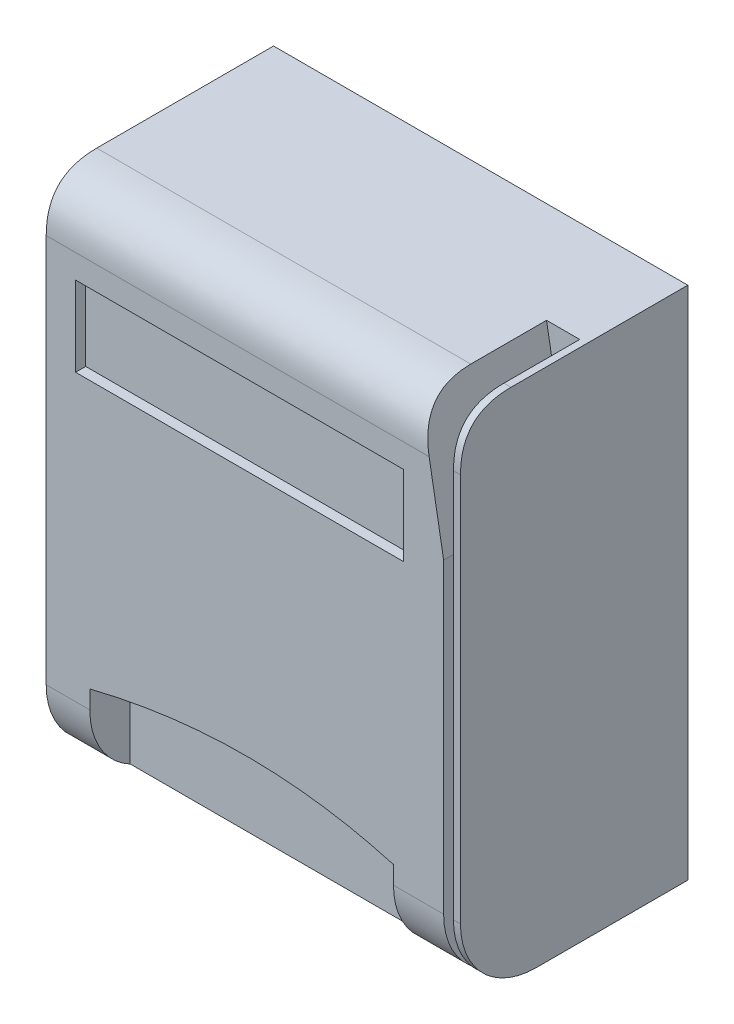
ISO-10303-21;
HEADER;
FILE_DESCRIPTION(('STEP AP214'),'2;1');
FILE_NAME('part.step','',(''),(''),'','','');
FILE_SCHEMA(('AUTOMOTIVE_DESIGN { 1 0 10303 214 1 1 1 1 }'));
ENDSEC;
DATA;
#1=APPLICATION_CONTEXT('core data for automotive mechanical design processes');
#2=APPLICATION_PROTOCOL_DEFINITION('international standard','automotive_design',2000,#1);
#3=PRODUCT_CONTEXT('',#1,'mechanical');
#4=PRODUCT('Part','Part','',(#3));
#5=PRODUCT_RELATED_PRODUCT_CATEGORY('part','',(#4));
#6=PRODUCT_DEFINITION_FORMATION('','',#4);
#7=PRODUCT_DEFINITION_CONTEXT('part definition',#1,'design');
#8=PRODUCT_DEFINITION('design','',#6,#7);
#9=PRODUCT_DEFINITION_SHAPE('','',#8);
#10=(LENGTH_UNIT() NAMED_UNIT(*) SI_UNIT(.MILLI.,.METRE.));
#11=(NAMED_UNIT(*) PLANE_ANGLE_UNIT() SI_UNIT($,.RADIAN.));
#12=(NAMED_UNIT(*) SI_UNIT($,.STERADIAN.) SOLID_ANGLE_UNIT());
#13=UNCERTAINTY_MEASURE_WITH_UNIT(LENGTH_MEASURE(1.E-05),#10,'distance_accuracy_value','');
#14=(GEOMETRIC_REPRESENTATION_CONTEXT(3) GLOBAL_UNCERTAINTY_ASSIGNED_CONTEXT((#13)) GLOBAL_UNIT_ASSIGNED_CONTEXT((#10,
#11,#12)) REPRESENTATION_CONTEXT('',''));
#15=CARTESIAN_POINT('',(0.,0.,0.));
#16=DIRECTION('',(0.,0.,1.));
#17=DIRECTION('',(1.,0.,0.));
#18=AXIS2_PLACEMENT_3D('',#15,#16,#17);
#19=CARTESIAN_POINT('',(0.,0.,45.));
#20=DIRECTION('',(0.,0.,1.));
#21=DIRECTION('',(1.,0.,0.));
#22=AXIS2_PLACEMENT_3D('',#19,#20,#21);
#23=PLANE('',#22);
#24=DIRECTION('',(0.,1.,0.));
#25=VECTOR('',#24,1.);
#26=CARTESIAN_POINT('',(34.887864684114,65.0411227847772,45.));
#27=LINE('',#26,#25);
#28=CARTESIAN_POINT('',(34.887864684114,-24.1995517306669,45.));
#29=VERTEX_POINT('',#28);
#30=CARTESIAN_POINT('',(34.887864684114,52.800448269333,45.));
#31=VERTEX_POINT('',#30);
#32=EDGE_CURVE('E282',#29,#31,#27,.T.);
#33=ORIENTED_EDGE('',*,*,#32,.F.);
#34=DIRECTION('',(1.,0.,0.));
#35=VECTOR('',#34,1.);
#36=CARTESIAN_POINT('',(36.2836520097918,-24.199551730667,45.));
#37=LINE('',#36,#35);
#38=CARTESIAN_POINT('',(36.2836520097918,-24.199551730667,45.));
#39=VERTEX_POINT('',#38);
#40=EDGE_CURVE('E458',#29,#39,#37,.T.);
#41=ORIENTED_EDGE('',*,*,#40,.T.);
#42=DIRECTION('',(0.,1.,0.));
#43=VECTOR('',#42,1.);
#44=CARTESIAN_POINT('',(36.2836520097918,62.800448269333,45.));
#45=LINE('',#44,#43);
#46=CARTESIAN_POINT('',(36.2836520097918,52.800448269333,45.));
#47=VERTEX_POINT('',#46);
#48=EDGE_CURVE('E323',#39,#47,#45,.T.);
#49=ORIENTED_EDGE('',*,*,#48,.T.);
#50=CARTESIAN_POINT('',(-49.8163479902082,52.800448269333,45.));
#51=CARTESIAN_POINT('',(-19.7496813235416,52.800448269333,45.));
#52=CARTESIAN_POINT('',(10.3169853431251,52.800448269333,45.));
#53=CARTESIAN_POINT('',(40.3836520097918,52.800448269333,45.));
#54=(BOUNDED_CURVE() B_SPLINE_CURVE(3,(#50,#51,#52,#53),.UNSPECIFIED.,.F.,
.F.) B_SPLINE_CURVE_WITH_KNOTS((4,4),(-0.0498163479902082,0.0403836520097918),
.UNSPECIFIED.) CURVE() GEOMETRIC_REPRESENTATION_ITEM() RATIONAL_B_SPLINE_CURVE((1.,1.,1.,1.)) REPRESENTATION_ITEM(''));
#55=EDGE_CURVE('E335',#47,#31,#54,.F.);
#56=ORIENTED_EDGE('',*,*,#55,.T.);
#57=EDGE_LOOP('',(#33,#41,#49,#56));
#58=FACE_BOUND('',#57,.T.);
#59=ADVANCED_FACE('F35',(#58),#23,.T.);
#60=CARTESIAN_POINT('',(0.,-24.199551730667,30.));
#61=DIRECTION('',(-1.,0.,0.));
#62=DIRECTION('',(0.,0.,1.));
#63=AXIS2_PLACEMENT_3D('',#60,#61,#62);
#64=CYLINDRICAL_SURFACE('',#63,15.);
#65=CARTESIAN_POINT('',(34.887864684114,-24.199551730667,30.));
#66=DIRECTION('',(1.,0.,0.));
#67=DIRECTION('',(0.,0.,-1.));
#68=AXIS2_PLACEMENT_3D('',#65,#66,#67);
#69=CIRCLE('',#68,15.);
#70=CARTESIAN_POINT('',(34.887864684114,-39.199551730667,30.));
#71=VERTEX_POINT('',#70);
#72=EDGE_CURVE('E304',#71,#29,#69,.F.);
#73=ORIENTED_EDGE('',*,*,#72,.F.);
#74=DIRECTION('',(1.,0.,0.));
#75=VECTOR('',#74,1.);
#76=CARTESIAN_POINT('',(-45.7163479902082,-39.199551730667,30.));
#77=LINE('',#76,#75);
#78=CARTESIAN_POINT('',(36.2836520097918,-39.199551730667,30.));
#79=VERTEX_POINT('',#78);
#80=EDGE_CURVE('E442',#79,#71,#77,.F.);
#81=ORIENTED_EDGE('',*,*,#80,.F.);
#82=CARTESIAN_POINT('',(36.2836520097918,-24.199551730667,30.));
#83=DIRECTION('',(-1.,0.,0.));
#84=DIRECTION('',(0.,-1.,0.));
#85=AXIS2_PLACEMENT_3D('',#82,#83,#84);
#86=CIRCLE('',#85,15.);
#87=EDGE_CURVE('E451',#39,#79,#86,.F.);
#88=ORIENTED_EDGE('',*,*,#87,.F.);
#89=ORIENTED_EDGE('',*,*,#40,.F.);
#90=EDGE_LOOP('',(#73,#81,#88,#89));
#91=FACE_BOUND('',#90,.T.);
#92=ADVANCED_FACE('F483',(#91),#64,.T.);
#93=CARTESIAN_POINT('',(-49.8163479902082,62.800448269333,35.));
#94=CARTESIAN_POINT('',(-19.7496813235416,62.800448269333,35.));
#95=CARTESIAN_POINT('',(10.3169853431251,62.800448269333,35.));
#96=CARTESIAN_POINT('',(40.3836520097918,62.800448269333,35.));
#97=CARTESIAN_POINT('',(-49.8163479902082,62.800448269333,45.));
#98=CARTESIAN_POINT('',(-19.7496813235416,62.800448269333,45.));
#99=CARTESIAN_POINT('',(10.3169853431251,62.800448269333,45.));
#100=CARTESIAN_POINT('',(40.3836520097918,62.800448269333,45.));
#101=CARTESIAN_POINT('',(-49.8163479902082,52.800448269333,45.));
#102=CARTESIAN_POINT('',(-19.7496813235416,52.800448269333,45.));
#103=CARTESIAN_POINT('',(10.3169853431251,52.800448269333,45.));
#104=CARTESIAN_POINT('',(40.3836520097918,52.800448269333,45.));
#105=(BOUNDED_SURFACE() B_SPLINE_SURFACE(2,3,((#93,#94,#95,#96),(#97,#98,#99,#100),(#101,#102,
#103,#104)),.UNSPECIFIED.,.F.,.F.,.F.) B_SPLINE_SURFACE_WITH_KNOTS((3,3),(4,4),(0.,1.),
(-0.0498163479902082,0.0403836520097918),
.UNSPECIFIED.) GEOMETRIC_REPRESENTATION_ITEM() RATIONAL_B_SPLINE_SURFACE(((1.,1.,1.,1.),(1.,1.,
1.,1.),(1.,1.,1.,1.))) REPRESENTATION_ITEM('') SURFACE());
#106=CARTESIAN_POINT('',(34.887864684114,52.800448269333,45.));
#107=CARTESIAN_POINT('',(34.887864684114,53.0758713042877,44.9999580147789));
#108=CARTESIAN_POINT('',(34.887864684114,53.3513813776729,44.9943067095754));
#109=CARTESIAN_POINT('',(34.887864684114,53.9037177229983,44.9699964173612));
#110=CARTESIAN_POINT('',(34.887864684114,54.1805399667056,44.9512479829907));
#111=CARTESIAN_POINT('',(34.887864684114,54.7335065237998,44.8988422322798));
#112=CARTESIAN_POINT('',(34.887864684114,55.009647459334,44.8651481004538));
#113=CARTESIAN_POINT('',(34.887864684114,55.5650672398233,44.7799058484809));
#114=CARTESIAN_POINT('',(34.887864684114,55.8442926612896,44.728002480084));
#115=CARTESIAN_POINT('',(34.887864684114,56.397714674445,44.6042560003653));
#116=CARTESIAN_POINT('',(34.887864684114,56.6719208797387,44.5324564866589));
#117=CARTESIAN_POINT('',(34.887864684114,57.2131234189181,44.3665272174461));
#118=CARTESIAN_POINT('',(34.887864684114,57.4801307821413,44.2724340716684));
#119=CARTESIAN_POINT('',(34.887864684114,57.9389802400098,44.0861243026727));
#120=CARTESIAN_POINT('',(34.887864684114,58.132998786702,43.9992625957234));
#121=CARTESIAN_POINT('',(34.887864684114,58.5138704266598,43.8109060507683));
#122=CARTESIAN_POINT('',(34.887864684114,58.7007228086328,43.7094097649113));
#123=CARTESIAN_POINT('',(34.887864684114,59.0642253217201,43.4921312559566));
#124=CARTESIAN_POINT('',(34.887864684114,59.2409365022191,43.3764515136131));
#125=CARTESIAN_POINT('',(34.887864684114,59.5837569770998,43.1303058219401));
#126=CARTESIAN_POINT('',(34.887864684114,59.749866823552,42.9998406435544));
#127=CARTESIAN_POINT('',(34.887864684114,60.0709761017422,42.7236936583387));
#128=CARTESIAN_POINT('',(34.887864684114,60.2258891278002,42.5779112365908));
#129=CARTESIAN_POINT('',(34.887864684114,60.5219329831805,42.2729721669509));
#130=CARTESIAN_POINT('',(34.887864684114,60.6630638673926,42.1138155723286));
#131=CARTESIAN_POINT('',(34.887864684114,60.9308684972675,41.7833296762792));
#132=CARTESIAN_POINT('',(34.887864684114,61.0575167507936,41.6119797466137));
#133=CARTESIAN_POINT('',(34.887864684114,61.2957028631016,41.259094955026));
#134=CARTESIAN_POINT('',(34.887864684114,61.4072390325782,41.0775589576557));
#135=CARTESIAN_POINT('',(34.887864684114,61.6382306938373,40.6652028646675));
#136=CARTESIAN_POINT('',(34.887864684114,61.7540245589697,40.4323307196768));
#137=CARTESIAN_POINT('',(34.887864684114,61.9643299228652,39.9571834744119));
#138=CARTESIAN_POINT('',(34.887864684114,62.0588350856129,39.7149055998585));
#139=CARTESIAN_POINT('',(34.887864684114,62.2285081870424,39.2226027088862));
#140=CARTESIAN_POINT('',(34.887864684114,62.3035938471781,38.9725496001214));
#141=CARTESIAN_POINT('',(34.887864684114,62.4357865085304,38.4678192216091));
#142=CARTESIAN_POINT('',(34.887864684114,62.4928953236776,38.213142421154));
#143=CARTESIAN_POINT('',(34.887864684114,62.5888841307358,37.7120827981705));
#144=CARTESIAN_POINT('',(34.887864684114,62.6284581428513,37.46583079516));
#145=CARTESIAN_POINT('',(34.887864684114,62.6945100900096,36.971563206277));
#146=CARTESIAN_POINT('',(34.887864684114,62.7209860302614,36.7235473576078));
#147=CARTESIAN_POINT('',(34.887864684114,62.7620109082715,36.2297055275107));
#148=CARTESIAN_POINT('',(34.887864684114,62.7767058617334,35.9838913066888));
#149=CARTESIAN_POINT('',(34.887864684114,62.7959076543318,35.4920338525714));
#150=CARTESIAN_POINT('',(34.887864684114,62.8004218070874,35.2459909107808));
#151=CARTESIAN_POINT('',(34.887864684114,62.800448269333,35.));
#152=B_SPLINE_CURVE_WITH_KNOTS('',3,(#106,#107,#108,#109,#110,#111,#112,#113,#114,#115,#116,
#117,#118,#119,#120,#121,#122,#123,#124,#125,#126,#127,#128,#129,#130,#131,#132,#133,#134,#135,
#136,#137,#138,#139,#140,#141,#142,#143,#144,#145,#146,#147,#148,#149,#150,#151),.UNSPECIFIED.,
.F.,.F.,(4,2,2,2,2,2,2,2,2,2,2,2,2,2,2,2,2,2,2,2,2,2,4),(0.,0.826344042373816,1.65838752041859,
2.49249203847485,3.34386800802407,4.19339294669632,5.04153238149717,5.67870579866925,
6.31594229699359,6.9488194317985,7.58166358222454,8.21896087044178,8.85625562040589,
9.49465540161644,10.1331264876112,10.9121469221822,11.6913989060087,12.4739003311537,
13.2563227736658,14.0041694880797,14.7521300619299,15.4906703983519,16.2286800176226),.UNSPECIFIED.);
#153=CARTESIAN_POINT('',(34.887864684114,62.800448269333,35.));
#154=VERTEX_POINT('',#153);
#155=EDGE_CURVE('E396',#31,#154,#152,.T.);
#156=CARTESIAN_POINT('',(36.2836520097918,52.800448269333,45.));
#157=CARTESIAN_POINT('',(36.2836520097918,62.800448269333,45.));
#158=CARTESIAN_POINT('',(36.2836520097918,62.800448269333,35.));
#159=(BOUNDED_CURVE() B_SPLINE_CURVE(2,(#156,#157,#158),.UNSPECIFIED.,.F.,
.F.) B_SPLINE_CURVE_WITH_KNOTS((3,3),(0.,1.),
.UNSPECIFIED.) CURVE() GEOMETRIC_REPRESENTATION_ITEM() RATIONAL_B_SPLINE_CURVE((1.,1.,1.)) REPRESENTATION_ITEM(''));
#160=CARTESIAN_POINT('',(36.2836520097918,62.800448269333,35.));
#161=VERTEX_POINT('',#160);
#162=EDGE_CURVE('E398',#161,#47,#159,.F.);
#163=CARTESIAN_POINT('',(40.3836520097918,62.800448269333,35.));
#164=CARTESIAN_POINT('',(10.3169853431251,62.800448269333,35.));
#165=CARTESIAN_POINT('',(-19.7496813235416,62.800448269333,35.));
#166=CARTESIAN_POINT('',(-49.8163479902082,62.800448269333,35.));
#167=(BOUNDED_CURVE() B_SPLINE_CURVE(3,(#163,#164,#165,#166),.UNSPECIFIED.,.F.,
.F.) B_SPLINE_CURVE_WITH_KNOTS((4,4),(-0.0498163479902082,0.0403836520097918),
.UNSPECIFIED.) CURVE() GEOMETRIC_REPRESENTATION_ITEM() RATIONAL_B_SPLINE_CURVE((1.,1.,1.,1.)) REPRESENTATION_ITEM(''));
#168=EDGE_CURVE('E387',#154,#161,#167,.F.);
#169=ORIENTED_EDGE('',*,*,#155,.F.);
#170=ORIENTED_EDGE('',*,*,#55,.F.);
#171=ORIENTED_EDGE('',*,*,#162,.F.);
#172=ORIENTED_EDGE('',*,*,#168,.F.);
#173=EDGE_LOOP('',(#169,#170,#171,#172));
#174=FACE_BOUND('',#173,.T.);
#175=ADVANCED_FACE('F480',(#174),#105,.T.);
#176=CARTESIAN_POINT('',(-45.7163479902082,62.800448269333,45.));
#177=DIRECTION('',(1.,0.,0.));
#178=DIRECTION('',(0.,1.,0.));
#179=AXIS2_PLACEMENT_3D('',#176,#177,#178);
#180=PLANE('',#179);
#181=DIRECTION('',(0.,-1.,0.));
#182=VECTOR('',#181,1.);
#183=CARTESIAN_POINT('',(-45.7163479902082,62.800448269333,45.));
#184=LINE('',#183,#182);
#185=CARTESIAN_POINT('',(-45.7163479902082,52.800448269333,45.));
#186=VERTEX_POINT('',#185);
#187=CARTESIAN_POINT('',(-45.7163479902082,-24.199551730667,45.));
#188=VERTEX_POINT('',#187);
#189=EDGE_CURVE('E320',#186,#188,#184,.T.);
#190=ORIENTED_EDGE('',*,*,#189,.F.);
#191=CARTESIAN_POINT('',(-45.7163479902082,62.800448269333,35.));
#192=CARTESIAN_POINT('',(-45.7163479902082,62.800448269333,45.));
#193=CARTESIAN_POINT('',(-45.7163479902082,52.800448269333,45.));
#194=(BOUNDED_CURVE() B_SPLINE_CURVE(2,(#191,#192,#193),.UNSPECIFIED.,.F.,
.F.) B_SPLINE_CURVE_WITH_KNOTS((3,3),(0.,1.),
.UNSPECIFIED.) CURVE() GEOMETRIC_REPRESENTATION_ITEM() RATIONAL_B_SPLINE_CURVE((1.,1.,1.)) REPRESENTATION_ITEM(''));
#195=CARTESIAN_POINT('',(-45.7163479902082,62.800448269333,35.));
#196=VERTEX_POINT('',#195);
#197=EDGE_CURVE('E436',#186,#196,#194,.F.);
#198=ORIENTED_EDGE('',*,*,#197,.T.);
#199=DIRECTION('',(0.,0.,-1.));
#200=VECTOR('',#199,1.);
#201=CARTESIAN_POINT('',(-45.7163479902082,62.800448269333,45.));
#202=LINE('',#201,#200);
#203=CARTESIAN_POINT('',(-45.7163479902082,62.800448269333,0.));
#204=VERTEX_POINT('',#203);
#205=EDGE_CURVE('E329',#196,#204,#202,.T.);
#206=ORIENTED_EDGE('',*,*,#205,.T.);
#207=DIRECTION('',(0.,-1.,0.));
#208=VECTOR('',#207,1.);
#209=CARTESIAN_POINT('',(-45.7163479902082,62.800448269333,0.));
#210=LINE('',#209,#208);
#211=CARTESIAN_POINT('',(-45.7163479902082,-39.199551730667,0.));
#212=VERTEX_POINT('',#211);
#213=EDGE_CURVE('E314',#204,#212,#210,.T.);
#214=ORIENTED_EDGE('',*,*,#213,.T.);
#215=DIRECTION('',(0.,0.,-1.));
#216=VECTOR('',#215,1.);
#217=CARTESIAN_POINT('',(-45.7163479902082,-39.199551730667,45.));
#218=LINE('',#217,#216);
#219=CARTESIAN_POINT('',(-45.7163479902082,-39.199551730667,30.));
#220=VERTEX_POINT('',#219);
#221=EDGE_CURVE('E459',#220,#212,#218,.T.);
#222=ORIENTED_EDGE('',*,*,#221,.F.);
#223=CARTESIAN_POINT('',(-45.7163479902082,-24.199551730667,30.));
#224=DIRECTION('',(1.,0.,0.));
#225=DIRECTION('',(0.,1.,0.));
#226=AXIS2_PLACEMENT_3D('',#223,#224,#225);
#227=CIRCLE('',#226,15.);
#228=EDGE_CURVE('E325',#220,#188,#227,.F.);
#229=ORIENTED_EDGE('',*,*,#228,.T.);
#230=EDGE_LOOP('',(#190,#198,#206,#214,#222,#229));
#231=FACE_BOUND('',#230,.T.);
#232=ADVANCED_FACE('F471',(#231),#180,.F.);
#233=CARTESIAN_POINT('',(-45.7163479902082,-39.199551730667,45.));
#234=DIRECTION('',(0.,1.,0.));
#235=DIRECTION('',(0.,0.,1.));
#236=AXIS2_PLACEMENT_3D('',#233,#234,#235);
#237=PLANE('',#236);
#238=ORIENTED_EDGE('',*,*,#80,.T.);
#239=DIRECTION('',(0.,0.,-1.));
#240=VECTOR('',#239,1.);
#241=CARTESIAN_POINT('',(34.887864684114,-39.199551730667,45.));
#242=LINE('',#241,#240);
#243=CARTESIAN_POINT('',(34.887864684114,-39.1995517306669,20.));
#244=VERTEX_POINT('',#243);
#245=EDGE_CURVE('E308',#71,#244,#242,.T.);
#246=ORIENTED_EDGE('',*,*,#245,.T.);
#247=DIRECTION('',(-1.,0.,0.));
#248=VECTOR('',#247,1.);
#249=CARTESIAN_POINT('',(-45.7163479902082,-39.199551730667,20.));
#250=LINE('',#249,#248);
#251=CARTESIAN_POINT('',(32.9523552464259,-39.1995517306669,20.));
#252=VERTEX_POINT('',#251);
#253=EDGE_CURVE('E311',#244,#252,#250,.T.);
#254=ORIENTED_EDGE('',*,*,#253,.T.);
#255=DIRECTION('',(0.,0.,1.));
#256=VECTOR('',#255,1.);
#257=CARTESIAN_POINT('',(32.9523552464259,-39.199551730667,45.));
#258=LINE('',#257,#256);
#259=CARTESIAN_POINT('',(32.9523552464259,-39.199551730667,30.));
#260=VERTEX_POINT('',#259);
#261=EDGE_CURVE('E298',#252,#260,#258,.T.);
#262=ORIENTED_EDGE('',*,*,#261,.T.);
#263=EDGE_CURVE('E447',#260,#220,#77,.F.);
#264=ORIENTED_EDGE('',*,*,#263,.T.);
#265=ORIENTED_EDGE('',*,*,#221,.T.);
#266=DIRECTION('',(1.,0.,0.));
#267=VECTOR('',#266,1.);
#268=CARTESIAN_POINT('',(-45.7163479902082,-39.199551730667,0.));
#269=LINE('',#268,#267);
#270=CARTESIAN_POINT('',(36.2836520097918,-39.199551730667,0.));
#271=VERTEX_POINT('',#270);
#272=EDGE_CURVE('E514',#212,#271,#269,.T.);
#273=ORIENTED_EDGE('',*,*,#272,.T.);
#274=DIRECTION('',(0.,0.,-1.));
#275=VECTOR('',#274,1.);
#276=CARTESIAN_POINT('',(36.2836520097918,-39.199551730667,45.));
#277=LINE('',#276,#275);
#278=EDGE_CURVE('E461',#79,#271,#277,.T.);
#279=ORIENTED_EDGE('',*,*,#278,.F.);
#280=EDGE_LOOP('',(#238,#246,#254,#262,#264,#265,#273,#279));
#281=FACE_BOUND('',#280,.T.);
#282=ADVANCED_FACE('F479',(#281),#237,.F.);
#283=CARTESIAN_POINT('',(36.2836520097918,62.800448269333,45.));
#284=DIRECTION('',(-1.,0.,0.));
#285=DIRECTION('',(0.,-1.,0.));
#286=AXIS2_PLACEMENT_3D('',#283,#284,#285);
#287=PLANE('',#286);
#288=DIRECTION('',(0.,0.,-1.));
#289=VECTOR('',#288,1.);
#290=CARTESIAN_POINT('',(36.2836520097918,62.800448269333,45.));
#291=LINE('',#290,#289);
#292=CARTESIAN_POINT('',(36.2836520097918,62.800448269333,0.));
#293=VERTEX_POINT('',#292);
#294=EDGE_CURVE('E463',#161,#293,#291,.T.);
#295=ORIENTED_EDGE('',*,*,#294,.F.);
#296=ORIENTED_EDGE('',*,*,#162,.T.);
#297=ORIENTED_EDGE('',*,*,#48,.F.);
#298=ORIENTED_EDGE('',*,*,#87,.T.);
#299=ORIENTED_EDGE('',*,*,#278,.T.);
#300=DIRECTION('',(0.,1.,0.));
#301=VECTOR('',#300,1.);
#302=CARTESIAN_POINT('',(36.2836520097918,62.800448269333,0.));
#303=LINE('',#302,#301);
#304=EDGE_CURVE('E515',#271,#293,#303,.T.);
#305=ORIENTED_EDGE('',*,*,#304,.T.);
#306=EDGE_LOOP('',(#295,#296,#297,#298,#299,#305));
#307=FACE_BOUND('',#306,.T.);
#308=ADVANCED_FACE('F365',(#307),#287,.F.);
#309=CARTESIAN_POINT('',(-45.7163479902082,62.800448269333,45.));
#310=DIRECTION('',(0.,-1.,0.));
#311=DIRECTION('',(0.,0.,-1.));
#312=AXIS2_PLACEMENT_3D('',#309,#310,#311);
#313=PLANE('',#312);
#314=CARTESIAN_POINT('',(40.3836520097918,62.800448269333,35.));
#315=CARTESIAN_POINT('',(10.3169853431251,62.800448269333,35.));
#316=CARTESIAN_POINT('',(-19.7496813235416,62.800448269333,35.));
#317=CARTESIAN_POINT('',(-49.8163479902082,62.800448269333,35.));
#318=(BOUNDED_CURVE() B_SPLINE_CURVE(3,(#314,#315,#316,#317),.UNSPECIFIED.,.F.,
.F.) B_SPLINE_CURVE_WITH_KNOTS((4,4),(-0.0498163479902082,0.0403836520097918),
.UNSPECIFIED.) CURVE() GEOMETRIC_REPRESENTATION_ITEM() RATIONAL_B_SPLINE_CURVE((1.,1.,1.,1.)) REPRESENTATION_ITEM(''));
#319=CARTESIAN_POINT('',(28.3230397480261,62.800448269333,35.));
#320=VERTEX_POINT('',#319);
#321=EDGE_CURVE('E435',#196,#320,#318,.F.);
#322=ORIENTED_EDGE('',*,*,#321,.T.);
#323=DIRECTION('',(0.,0.,-1.));
#324=VECTOR('',#323,1.);
#325=CARTESIAN_POINT('',(28.3230397480261,62.800448269333,45.));
#326=LINE('',#325,#324);
#327=CARTESIAN_POINT('',(28.3230397480261,62.800448269333,20.));
#328=VERTEX_POINT('',#327);
#329=EDGE_CURVE('E279',#320,#328,#326,.T.);
#330=ORIENTED_EDGE('',*,*,#329,.T.);
#331=DIRECTION('',(1.,0.,0.));
#332=VECTOR('',#331,1.);
#333=CARTESIAN_POINT('',(-45.7163479902082,62.800448269333,20.));
#334=LINE('',#333,#332);
#335=CARTESIAN_POINT('',(34.887864684114,62.800448269333,20.));
#336=VERTEX_POINT('',#335);
#337=EDGE_CURVE('E46',#328,#336,#334,.T.);
#338=ORIENTED_EDGE('',*,*,#337,.T.);
#339=DIRECTION('',(0.,0.,1.));
#340=VECTOR('',#339,1.);
#341=CARTESIAN_POINT('',(34.887864684114,62.800448269333,45.));
#342=LINE('',#341,#340);
#343=EDGE_CURVE('E301',#336,#154,#342,.T.);
#344=ORIENTED_EDGE('',*,*,#343,.T.);
#345=ORIENTED_EDGE('',*,*,#168,.T.);
#346=ORIENTED_EDGE('',*,*,#294,.T.);
#347=DIRECTION('',(-1.,0.,0.));
#348=VECTOR('',#347,1.);
#349=CARTESIAN_POINT('',(-45.7163479902082,62.800448269333,0.));
#350=LINE('',#349,#348);
#351=EDGE_CURVE('E324',#293,#204,#350,.T.);
#352=ORIENTED_EDGE('',*,*,#351,.T.);
#353=ORIENTED_EDGE('',*,*,#205,.F.);
#354=EDGE_LOOP('',(#322,#330,#338,#344,#345,#346,#352,#353));
#355=FACE_BOUND('',#354,.T.);
#356=ADVANCED_FACE('F354',(#355),#313,.F.);
#357=DIRECTION('',(0.,-1.,0.));
#358=VECTOR('',#357,1.);
#359=CARTESIAN_POINT('',(-37.0796235242334,-20.5978817772774,45.));
#360=LINE('',#359,#358);
#361=CARTESIAN_POINT('',(-37.0796235242334,-20.5978817772774,45.));
#362=VERTEX_POINT('',#361);
#363=CARTESIAN_POINT('',(-37.0796235242334,-24.199551730667,45.));
#364=VERTEX_POINT('',#363);
#365=EDGE_CURVE('E215',#362,#364,#360,.T.);
#366=ORIENTED_EDGE('',*,*,#365,.F.);
#367=CARTESIAN_POINT('',(22.8156773511232,-20.5978817772774,45.));
#368=CARTESIAN_POINT('',(-5.10202603758446,-12.5908647179897,45.));
#369=CARTESIAN_POINT('',(-37.0796235242334,-20.5978817772774,45.));
#370=B_SPLINE_CURVE_WITH_KNOTS('',2,(#367,#368,#369),.UNSPECIFIED.,.F.,.F.,(3,3),(0.,
0.561199211058724),.UNSPECIFIED.);
#371=CARTESIAN_POINT('',(22.8156773511232,-20.5978817772774,45.));
#372=VERTEX_POINT('',#371);
#373=EDGE_CURVE('E224',#372,#362,#370,.T.);
#374=ORIENTED_EDGE('',*,*,#373,.F.);
#375=DIRECTION('',(-1.,0.,0.));
#376=VECTOR('',#375,1.);
#377=CARTESIAN_POINT('',(-37.0796235242334,-20.5978817772774,45.));
#378=LINE('',#377,#376);
#379=CARTESIAN_POINT('',(23.0255899112137,-20.5978817772774,45.));
#380=VERTEX_POINT('',#379);
#381=EDGE_CURVE('E219',#380,#372,#378,.T.);
#382=ORIENTED_EDGE('',*,*,#381,.F.);
#383=DIRECTION('',(0.,1.,0.));
#384=VECTOR('',#383,1.);
#385=CARTESIAN_POINT('',(23.0255899112137,-20.5978817772774,45.));
#386=LINE('',#385,#384);
#387=CARTESIAN_POINT('',(23.0255899112137,-24.199551730667,45.));
#388=VERTEX_POINT('',#387);
#389=EDGE_CURVE('E204',#388,#380,#386,.T.);
#390=ORIENTED_EDGE('',*,*,#389,.F.);
#391=CARTESIAN_POINT('',(32.9523552464259,-24.1995517306669,45.));
#392=VERTEX_POINT('',#391);
#393=EDGE_CURVE('E457',#388,#392,#37,.T.);
#394=ORIENTED_EDGE('',*,*,#393,.T.);
#395=DIRECTION('',(0.,-1.,0.));
#396=VECTOR('',#395,1.);
#397=CARTESIAN_POINT('',(32.9523552464259,65.0411227847772,45.));
#398=LINE('',#397,#396);
#399=CARTESIAN_POINT('',(32.9523552464259,36.5116662897913,45.));
#400=VERTEX_POINT('',#399);
#401=EDGE_CURVE('E289',#400,#392,#398,.T.);
#402=ORIENTED_EDGE('',*,*,#401,.F.);
#403=DIRECTION('',(0.173426322035258,-0.984846846380351,0.));
#404=VECTOR('',#403,1.);
#405=CARTESIAN_POINT('',(32.9523552464259,36.5116662897913,45.));
#406=LINE('',#405,#404);
#407=CARTESIAN_POINT('',(30.0839868706438,52.800448269333,45.));
#408=VERTEX_POINT('',#407);
#409=EDGE_CURVE('E524',#408,#400,#406,.T.);
#410=ORIENTED_EDGE('',*,*,#409,.F.);
#411=CARTESIAN_POINT('',(-49.8163479902082,52.800448269333,45.));
#412=CARTESIAN_POINT('',(-19.7496813235416,52.800448269333,45.));
#413=CARTESIAN_POINT('',(10.3169853431251,52.800448269333,45.));
#414=CARTESIAN_POINT('',(40.3836520097918,52.800448269333,45.));
#415=(BOUNDED_CURVE() B_SPLINE_CURVE(3,(#411,#412,#413,#414),.UNSPECIFIED.,.F.,
.F.) B_SPLINE_CURVE_WITH_KNOTS((4,4),(-0.0498163479902082,0.0403836520097918),
.UNSPECIFIED.) CURVE() GEOMETRIC_REPRESENTATION_ITEM() RATIONAL_B_SPLINE_CURVE((1.,1.,1.,1.)) REPRESENTATION_ITEM(''));
#416=EDGE_CURVE('E410',#408,#186,#415,.F.);
#417=ORIENTED_EDGE('',*,*,#416,.T.);
#418=ORIENTED_EDGE('',*,*,#189,.T.);
#419=EDGE_CURVE('E454',#188,#364,#37,.T.);
#420=ORIENTED_EDGE('',*,*,#419,.T.);
#421=EDGE_LOOP('',(#366,#374,#382,#390,#394,#402,#410,#417,#418,#420));
#422=FACE_BOUND('',#421,.T.);
#423=DIRECTION('',(0.,-1.,0.));
#424=VECTOR('',#423,1.);
#425=CARTESIAN_POINT('',(-39.9017692382237,48.0878330182613,45.));
#426=LINE('',#425,#424);
#427=CARTESIAN_POINT('',(-39.9017692382237,48.0878330182613,45.));
#428=VERTEX_POINT('',#427);
#429=CARTESIAN_POINT('',(-39.9017692382237,32.2784815547017,45.));
#430=VERTEX_POINT('',#429);
#431=EDGE_CURVE('E53',#428,#430,#426,.T.);
#432=ORIENTED_EDGE('',*,*,#431,.F.);
#433=DIRECTION('',(-1.,0.,0.));
#434=VECTOR('',#433,1.);
#435=CARTESIAN_POINT('',(-39.9017692382237,48.0878330182613,45.));
#436=LINE('',#435,#434);
#437=CARTESIAN_POINT('',(25.0425748194045,48.0878330182613,45.));
#438=VERTEX_POINT('',#437);
#439=EDGE_CURVE('E539',#438,#428,#436,.T.);
#440=ORIENTED_EDGE('',*,*,#439,.F.);
#441=DIRECTION('',(0.,1.,0.));
#442=VECTOR('',#441,1.);
#443=CARTESIAN_POINT('',(25.0425748194045,48.0878330182613,45.));
#444=LINE('',#443,#442);
#445=CARTESIAN_POINT('',(25.0425748194045,32.2784815547017,45.));
#446=VERTEX_POINT('',#445);
#447=EDGE_CURVE('E543',#446,#438,#444,.T.);
#448=ORIENTED_EDGE('',*,*,#447,.F.);
#449=DIRECTION('',(1.,0.,0.));
#450=VECTOR('',#449,1.);
#451=CARTESIAN_POINT('',(-39.9017692382237,32.2784815547017,45.));
#452=LINE('',#451,#450);
#453=EDGE_CURVE('E546',#430,#446,#452,.T.);
#454=ORIENTED_EDGE('',*,*,#453,.F.);
#455=EDGE_LOOP('',(#432,#440,#448,#454));
#456=FACE_BOUND('',#455,.T.);
#457=ADVANCED_FACE('F343',(#422,#456),#23,.T.);
#458=CARTESIAN_POINT('',(0.,0.,0.));
#459=DIRECTION('',(0.,0.,1.));
#460=DIRECTION('',(1.,0.,0.));
#461=AXIS2_PLACEMENT_3D('',#458,#459,#460);
#462=PLANE('',#461);
#463=CARTESIAN_POINT('',(28.7836520097917,-24.199551730667,0.));
#464=DIRECTION('',(0.,0.,-1.));
#465=DIRECTION('',(-1.,0.,0.));
#466=AXIS2_PLACEMENT_3D('',#463,#464,#465);
#467=CIRCLE('',#466,1.5);
#468=CARTESIAN_POINT('',(27.2836520097917,-24.199551730667,0.));
#469=VERTEX_POINT('',#468);
#470=EDGE_CURVE('E584',#469,#469,#467,.T.);
#471=ORIENTED_EDGE('',*,*,#470,.F.);
#472=EDGE_LOOP('',(#471));
#473=FACE_BOUND('',#472,.T.);
#474=CARTESIAN_POINT('',(-38.2163479902082,-24.199551730667,0.));
#475=DIRECTION('',(0.,0.,-1.));
#476=DIRECTION('',(-1.,0.,0.));
#477=AXIS2_PLACEMENT_3D('',#474,#475,#476);
#478=CIRCLE('',#477,1.5);
#479=CARTESIAN_POINT('',(-39.7163479902082,-24.199551730667,0.));
#480=VERTEX_POINT('',#479);
#481=EDGE_CURVE('E578',#480,#480,#478,.T.);
#482=ORIENTED_EDGE('',*,*,#481,.F.);
#483=EDGE_LOOP('',(#482));
#484=FACE_BOUND('',#483,.T.);
#485=CARTESIAN_POINT('',(-38.2163479902082,47.800448269333,0.));
#486=DIRECTION('',(0.,0.,-1.));
#487=DIRECTION('',(-1.,0.,0.));
#488=AXIS2_PLACEMENT_3D('',#485,#486,#487);
#489=CIRCLE('',#488,1.5);
#490=CARTESIAN_POINT('',(-39.7163479902082,47.800448269333,0.));
#491=VERTEX_POINT('',#490);
#492=EDGE_CURVE('E572',#491,#491,#489,.T.);
#493=ORIENTED_EDGE('',*,*,#492,.F.);
#494=EDGE_LOOP('',(#493));
#495=FACE_BOUND('',#494,.T.);
#496=CARTESIAN_POINT('',(28.7836520097918,47.800448269333,0.));
#497=DIRECTION('',(0.,0.,-1.));
#498=DIRECTION('',(-1.,0.,0.));
#499=AXIS2_PLACEMENT_3D('',#496,#497,#498);
#500=CIRCLE('',#499,1.5);
#501=CARTESIAN_POINT('',(27.2836520097918,47.800448269333,0.));
#502=VERTEX_POINT('',#501);
#503=EDGE_CURVE('E566',#502,#502,#500,.T.);
#504=ORIENTED_EDGE('',*,*,#503,.F.);
#505=EDGE_LOOP('',(#504));
#506=FACE_BOUND('',#505,.T.);
#507=ORIENTED_EDGE('',*,*,#213,.F.);
#508=ORIENTED_EDGE('',*,*,#351,.F.);
#509=ORIENTED_EDGE('',*,*,#304,.F.);
#510=ORIENTED_EDGE('',*,*,#272,.F.);
#511=EDGE_LOOP('',(#507,#508,#509,#510));
#512=FACE_BOUND('',#511,.T.);
#513=ADVANCED_FACE('F353',(#473,#484,#495,#506,#512),#462,.F.);
#514=CARTESIAN_POINT('',(-37.0796235242334,-24.199551730667,30.));
#515=DIRECTION('',(-1.,0.,0.));
#516=DIRECTION('',(0.,0.,1.));
#517=AXIS2_PLACEMENT_3D('',#514,#515,#516);
#518=CIRCLE('',#517,15.);
#519=CARTESIAN_POINT('',(-37.0796235242334,-37.4660508920886,37.));
#520=VERTEX_POINT('',#519);
#521=EDGE_CURVE('E222',#364,#520,#518,.F.);
#522=ORIENTED_EDGE('',*,*,#521,.F.);
#523=ORIENTED_EDGE('',*,*,#419,.F.);
#524=ORIENTED_EDGE('',*,*,#228,.F.);
#525=ORIENTED_EDGE('',*,*,#263,.F.);
#526=CARTESIAN_POINT('',(32.9523552464259,-24.199551730667,30.));
#527=DIRECTION('',(-1.,0.,0.));
#528=DIRECTION('',(0.,-1.,0.));
#529=AXIS2_PLACEMENT_3D('',#526,#527,#528);
#530=CIRCLE('',#529,15.);
#531=EDGE_CURVE('E291',#392,#260,#530,.F.);
#532=ORIENTED_EDGE('',*,*,#531,.F.);
#533=ORIENTED_EDGE('',*,*,#393,.F.);
#534=CARTESIAN_POINT('',(23.0255899112137,-24.199551730667,30.));
#535=DIRECTION('',(1.,0.,0.));
#536=DIRECTION('',(0.,0.,-1.));
#537=AXIS2_PLACEMENT_3D('',#534,#535,#536);
#538=CIRCLE('',#537,15.);
#539=CARTESIAN_POINT('',(23.0255899112137,-37.4660508920886,37.));
#540=VERTEX_POINT('',#539);
#541=EDGE_CURVE('E12',#540,#388,#538,.F.);
#542=ORIENTED_EDGE('',*,*,#541,.F.);
#543=DIRECTION('',(-1.,0.,0.));
#544=VECTOR('',#543,1.);
#545=CARTESIAN_POINT('',(0.,-37.4660508920886,37.));
#546=LINE('',#545,#544);
#547=EDGE_CURVE('E195',#540,#520,#546,.T.);
#548=ORIENTED_EDGE('',*,*,#547,.T.);
#549=EDGE_LOOP('',(#522,#523,#524,#525,#532,#533,#542,#548));
#550=FACE_BOUND('',#549,.T.);
#551=ADVANCED_FACE('F360',(#550),#64,.T.);
#552=CARTESIAN_POINT('',(28.3230397480261,62.800448269333,35.));
#553=CARTESIAN_POINT('',(28.323046587919,62.8004094272079,35.2715991022205));
#554=CARTESIAN_POINT('',(28.3240146237997,62.7949121816159,35.5432824851899));
#555=CARTESIAN_POINT('',(28.3281732018021,62.7712966059467,36.0878716582759));
#556=CARTESIAN_POINT('',(28.3313784090882,62.7530949958874,36.3607736401715));
#557=CARTESIAN_POINT('',(28.3403296503114,62.7022630253627,36.9058838146208));
#558=CARTESIAN_POINT('',(28.3460816803698,62.6695986143507,37.1780888360354));
#559=CARTESIAN_POINT('',(28.3606152823524,62.5870657444198,37.7254036111968));
#560=CARTESIAN_POINT('',(28.3694549779794,62.5368672148136,38.0004630508798));
#561=CARTESIAN_POINT('',(28.3905088646846,62.4173071983044,38.5457120564369));
#562=CARTESIAN_POINT('',(28.4027159892901,62.3479858402199,38.8159105717624));
#563=CARTESIAN_POINT('',(28.4308976607754,62.1879488287541,39.3493469584139));
#564=CARTESIAN_POINT('',(28.4468663222542,62.0972665971656,39.6125949962415));
#565=CARTESIAN_POINT('',(28.4787390809607,61.9162687790191,40.0692918557932));
#566=CARTESIAN_POINT('',(28.4937919311373,61.8307872220591,40.2647169520035));
#567=CARTESIAN_POINT('',(28.5264621877964,61.6452606026648,40.6483750114938));
#568=CARTESIAN_POINT('',(28.5440798283046,61.5452142112545,40.8366073164831));
#569=CARTESIAN_POINT('',(28.5818195124116,61.3308995187674,41.2028446611982));
#570=CARTESIAN_POINT('',(28.6019238604851,61.2167317063711,41.3809101252735));
#571=CARTESIAN_POINT('',(28.6447194960791,60.9737054675689,41.7264012185629));
#572=CARTESIAN_POINT('',(28.6674106533212,60.8448477809826,41.8938273829385));
#573=CARTESIAN_POINT('',(28.7154458157484,60.5720675151233,42.2175050717679));
#574=CARTESIAN_POINT('',(28.7408068031579,60.4280484978354,42.3736729122263));
#575=CARTESIAN_POINT('',(28.7938630048378,60.1267549439379,42.6722087009832));
#576=CARTESIAN_POINT('',(28.8215582112397,59.9694804520113,42.8145766957963));
#577=CARTESIAN_POINT('',(28.8790718535216,59.6428741528036,43.0848542094082));
#578=CARTESIAN_POINT('',(28.9088938781604,59.4735219658142,43.2127383003006));
#579=CARTESIAN_POINT('',(28.9703148113332,59.1247270906931,43.4534079887745));
#580=CARTESIAN_POINT('',(29.0019139207262,58.945283261931,43.5661918747315));
#581=CARTESIAN_POINT('',(29.073948746556,58.5362146141304,43.8008021714869));
#582=CARTESIAN_POINT('',(29.1147568263913,58.3044752318903,43.918829337112));
#583=CARTESIAN_POINT('',(29.1980363431151,57.8315506582096,44.1333792918921));
#584=CARTESIAN_POINT('',(29.2405082821927,57.5903626149565,44.2298955288601));
#585=CARTESIAN_POINT('',(29.3268276200674,57.1001756197538,44.4034200512055));
#586=CARTESIAN_POINT('',(29.3706801358496,56.851147609662,44.4803429129924));
#587=CARTESIAN_POINT('',(29.4592066240121,56.3484267327806,44.6160455328688));
#588=CARTESIAN_POINT('',(29.5038805136249,56.0947343360071,44.6748271084993));
#589=CARTESIAN_POINT('',(29.5931281231846,55.5879183821753,44.7754700081736));
#590=CARTESIAN_POINT('',(29.6376941734364,55.3348383794917,44.8175608408435));
#591=CARTESIAN_POINT('',(29.7271598496055,54.8267840772357,44.8877510976976));
#592=CARTESIAN_POINT('',(29.7720595368857,54.5718094291984,44.9158478800275));
#593=CARTESIAN_POINT('',(29.8614473779127,54.0641971342072,44.9593382699831));
#594=CARTESIAN_POINT('',(29.905933247167,53.8115724603429,44.9748930024309));
#595=CARTESIAN_POINT('',(29.9949450858668,53.306095393164,44.9952045063608));
#596=CARTESIAN_POINT('',(30.0394709949175,53.0532433428167,44.9999698911081));
#597=CARTESIAN_POINT('',(30.0839868706438,52.800448269333,45.));
#598=B_SPLINE_CURVE_WITH_KNOTS('',3,(#552,#553,#554,#555,#556,#557,#558,#559,#560,#561,#562,
#563,#564,#565,#566,#567,#568,#569,#570,#571,#572,#573,#574,#575,#576,#577,#578,#579,#580,#581,
#582,#583,#584,#585,#586,#587,#588,#589,#590,#591,#592,#593,#594,#595,#596,#597),.UNSPECIFIED.,
.F.,.F.,(4,2,2,2,2,2,2,2,2,2,2,2,2,2,2,2,2,2,2,2,2,2,4),(0.,0.814868548651762,1.6351295345409,
2.45733205944268,3.29592979180545,4.13278096003972,4.96833136520712,5.60927013991048,
6.25026743410584,6.88694077809985,7.52358207175477,8.16455038017321,8.80551652803225,
9.44759106072747,10.0897383117537,10.8782645799846,11.6670307045161,12.4591790137994,
13.2512479334652,14.0320126526542,14.812924711988,15.5836371693262,16.3537341404308),.UNSPECIFIED.);
#599=EDGE_CURVE('E277',#320,#408,#598,.T.);
#600=ORIENTED_EDGE('',*,*,#599,.F.);
#601=ORIENTED_EDGE('',*,*,#321,.F.);
#602=ORIENTED_EDGE('',*,*,#197,.F.);
#603=ORIENTED_EDGE('',*,*,#416,.F.);
#604=EDGE_LOOP('',(#600,#601,#602,#603));
#605=FACE_BOUND('',#604,.T.);
#606=ADVANCED_FACE('F37',(#605),#105,.T.);
#607=CARTESIAN_POINT('',(0.,0.,20.));
#608=DIRECTION('',(0.,0.,-1.));
#609=DIRECTION('',(-1.,0.,0.));
#610=AXIS2_PLACEMENT_3D('',#607,#608,#609);
#611=PLANE('',#610);
#612=DIRECTION('',(0.,1.,0.));
#613=VECTOR('',#612,1.);
#614=CARTESIAN_POINT('',(34.887864684114,65.0411227847772,20.));
#615=LINE('',#614,#613);
#616=EDGE_CURVE('E285',#244,#336,#615,.T.);
#617=ORIENTED_EDGE('',*,*,#616,.T.);
#618=ORIENTED_EDGE('',*,*,#337,.F.);
#619=DIRECTION('',(0.173426322035258,-0.984846846380351,0.));
#620=VECTOR('',#619,1.);
#621=CARTESIAN_POINT('',(32.9523552464259,36.5116662897913,20.));
#622=LINE('',#621,#620);
#623=CARTESIAN_POINT('',(32.9523552464259,36.5116662897913,20.));
#624=VERTEX_POINT('',#623);
#625=EDGE_CURVE('E523',#328,#624,#622,.T.);
#626=ORIENTED_EDGE('',*,*,#625,.T.);
#627=DIRECTION('',(0.,-1.,0.));
#628=VECTOR('',#627,1.);
#629=CARTESIAN_POINT('',(32.9523552464259,65.0411227847772,20.));
#630=LINE('',#629,#628);
#631=EDGE_CURVE('E288',#624,#252,#630,.T.);
#632=ORIENTED_EDGE('',*,*,#631,.T.);
#633=ORIENTED_EDGE('',*,*,#253,.F.);
#634=EDGE_LOOP('',(#617,#618,#626,#632,#633));
#635=FACE_BOUND('',#634,.T.);
#636=ADVANCED_FACE('F268',(#635),#611,.F.);
#637=CARTESIAN_POINT('',(34.887864684114,65.0411227847772,20.));
#638=DIRECTION('',(1.,0.,0.));
#639=DIRECTION('',(0.,0.,-1.));
#640=AXIS2_PLACEMENT_3D('',#637,#638,#639);
#641=PLANE('',#640);
#642=ORIENTED_EDGE('',*,*,#72,.T.);
#643=ORIENTED_EDGE('',*,*,#32,.T.);
#644=ORIENTED_EDGE('',*,*,#155,.T.);
#645=ORIENTED_EDGE('',*,*,#343,.F.);
#646=ORIENTED_EDGE('',*,*,#616,.F.);
#647=ORIENTED_EDGE('',*,*,#245,.F.);
#648=EDGE_LOOP('',(#642,#643,#644,#645,#646,#647));
#649=FACE_BOUND('',#648,.T.);
#650=ADVANCED_FACE('F356',(#649),#641,.F.);
#651=CARTESIAN_POINT('',(32.9523552464259,65.0411227847772,20.));
#652=DIRECTION('',(-1.,0.,0.));
#653=DIRECTION('',(0.,-1.,0.));
#654=AXIS2_PLACEMENT_3D('',#651,#652,#653);
#655=PLANE('',#654);
#656=ORIENTED_EDGE('',*,*,#631,.F.);
#657=DIRECTION('',(0.,0.,1.));
#658=VECTOR('',#657,1.);
#659=CARTESIAN_POINT('',(32.9523552464259,36.5116662897913,20.));
#660=LINE('',#659,#658);
#661=EDGE_CURVE('E61',#624,#400,#660,.T.);
#662=ORIENTED_EDGE('',*,*,#661,.T.);
#663=ORIENTED_EDGE('',*,*,#401,.T.);
#664=ORIENTED_EDGE('',*,*,#531,.T.);
#665=ORIENTED_EDGE('',*,*,#261,.F.);
#666=EDGE_LOOP('',(#656,#662,#663,#664,#665));
#667=FACE_BOUND('',#666,.T.);
#668=ADVANCED_FACE('F267',(#667),#655,.F.);
#669=CARTESIAN_POINT('',(32.9523552464259,36.5116662897913,20.));
#670=DIRECTION('',(-0.984846846380351,-0.173426322035258,0.));
#671=DIRECTION('',(0.173426322035258,-0.984846846380351,0.));
#672=AXIS2_PLACEMENT_3D('',#669,#670,#671);
#673=PLANE('',#672);
#674=ORIENTED_EDGE('',*,*,#599,.T.);
#675=ORIENTED_EDGE('',*,*,#409,.T.);
#676=ORIENTED_EDGE('',*,*,#661,.F.);
#677=ORIENTED_EDGE('',*,*,#625,.F.);
#678=ORIENTED_EDGE('',*,*,#329,.F.);
#679=EDGE_LOOP('',(#674,#675,#676,#677,#678));
#680=FACE_BOUND('',#679,.T.);
#681=ADVANCED_FACE('F263',(#680),#673,.F.);
#682=CARTESIAN_POINT('',(-39.9017692382237,48.0878330182613,43.));
#683=DIRECTION('',(-1.,0.,0.));
#684=DIRECTION('',(0.,0.,1.));
#685=AXIS2_PLACEMENT_3D('',#682,#683,#684);
#686=PLANE('',#685);
#687=ORIENTED_EDGE('',*,*,#431,.T.);
#688=DIRECTION('',(0.,0.,1.));
#689=VECTOR('',#688,1.);
#690=CARTESIAN_POINT('',(-39.9017692382237,32.2784815547017,43.));
#691=LINE('',#690,#689);
#692=CARTESIAN_POINT('',(-39.9017692382237,32.2784815547017,43.));
#693=VERTEX_POINT('',#692);
#694=EDGE_CURVE('E530',#693,#430,#691,.T.);
#695=ORIENTED_EDGE('',*,*,#694,.F.);
#696=DIRECTION('',(0.,-1.,0.));
#697=VECTOR('',#696,1.);
#698=CARTESIAN_POINT('',(-39.9017692382237,48.0878330182613,43.));
#699=LINE('',#698,#697);
#700=CARTESIAN_POINT('',(-39.9017692382237,48.0878330182613,43.));
#701=VERTEX_POINT('',#700);
#702=EDGE_CURVE('E542',#701,#693,#699,.T.);
#703=ORIENTED_EDGE('',*,*,#702,.F.);
#704=DIRECTION('',(0.,0.,1.));
#705=VECTOR('',#704,1.);
#706=CARTESIAN_POINT('',(-39.9017692382237,48.0878330182613,43.));
#707=LINE('',#706,#705);
#708=EDGE_CURVE('E527',#701,#428,#707,.T.);
#709=ORIENTED_EDGE('',*,*,#708,.T.);
#710=EDGE_LOOP('',(#687,#695,#703,#709));
#711=FACE_BOUND('',#710,.T.);
#712=ADVANCED_FACE('F253',(#711),#686,.F.);
#713=CARTESIAN_POINT('',(-39.9017692382237,48.0878330182613,43.));
#714=DIRECTION('',(0.,1.,0.));
#715=DIRECTION('',(0.,0.,1.));
#716=AXIS2_PLACEMENT_3D('',#713,#714,#715);
#717=PLANE('',#716);
#718=ORIENTED_EDGE('',*,*,#439,.T.);
#719=ORIENTED_EDGE('',*,*,#708,.F.);
#720=DIRECTION('',(-1.,0.,0.));
#721=VECTOR('',#720,1.);
#722=CARTESIAN_POINT('',(-39.9017692382237,48.0878330182613,43.));
#723=LINE('',#722,#721);
#724=CARTESIAN_POINT('',(25.0425748194045,48.0878330182613,43.));
#725=VERTEX_POINT('',#724);
#726=EDGE_CURVE('E534',#725,#701,#723,.T.);
#727=ORIENTED_EDGE('',*,*,#726,.F.);
#728=DIRECTION('',(0.,0.,1.));
#729=VECTOR('',#728,1.);
#730=CARTESIAN_POINT('',(25.0425748194045,48.0878330182613,43.));
#731=LINE('',#730,#729);
#732=EDGE_CURVE('E536',#725,#438,#731,.T.);
#733=ORIENTED_EDGE('',*,*,#732,.T.);
#734=EDGE_LOOP('',(#718,#719,#727,#733));
#735=FACE_BOUND('',#734,.T.);
#736=ADVANCED_FACE('F249',(#735),#717,.F.);
#737=CARTESIAN_POINT('',(25.0425748194045,48.0878330182613,43.));
#738=DIRECTION('',(1.,0.,0.));
#739=DIRECTION('',(0.,0.,-1.));
#740=AXIS2_PLACEMENT_3D('',#737,#738,#739);
#741=PLANE('',#740);
#742=ORIENTED_EDGE('',*,*,#447,.T.);
#743=ORIENTED_EDGE('',*,*,#732,.F.);
#744=DIRECTION('',(0.,1.,0.));
#745=VECTOR('',#744,1.);
#746=CARTESIAN_POINT('',(25.0425748194045,48.0878330182613,43.));
#747=LINE('',#746,#745);
#748=CARTESIAN_POINT('',(25.0425748194045,32.2784815547017,43.));
#749=VERTEX_POINT('',#748);
#750=EDGE_CURVE('E552',#749,#725,#747,.T.);
#751=ORIENTED_EDGE('',*,*,#750,.F.);
#752=DIRECTION('',(0.,0.,1.));
#753=VECTOR('',#752,1.);
#754=CARTESIAN_POINT('',(25.0425748194045,32.2784815547017,43.));
#755=LINE('',#754,#753);
#756=EDGE_CURVE('E533',#749,#446,#755,.T.);
#757=ORIENTED_EDGE('',*,*,#756,.T.);
#758=EDGE_LOOP('',(#742,#743,#751,#757));
#759=FACE_BOUND('',#758,.T.);
#760=ADVANCED_FACE('F252',(#759),#741,.F.);
#761=CARTESIAN_POINT('',(-39.9017692382237,32.2784815547017,43.));
#762=DIRECTION('',(0.,-1.,0.));
#763=DIRECTION('',(0.,0.,-1.));
#764=AXIS2_PLACEMENT_3D('',#761,#762,#763);
#765=PLANE('',#764);
#766=ORIENTED_EDGE('',*,*,#453,.T.);
#767=ORIENTED_EDGE('',*,*,#756,.F.);
#768=DIRECTION('',(1.,0.,0.));
#769=VECTOR('',#768,1.);
#770=CARTESIAN_POINT('',(-39.9017692382237,32.2784815547017,43.));
#771=LINE('',#770,#769);
#772=EDGE_CURVE('E555',#693,#749,#771,.T.);
#773=ORIENTED_EDGE('',*,*,#772,.F.);
#774=ORIENTED_EDGE('',*,*,#694,.T.);
#775=EDGE_LOOP('',(#766,#767,#773,#774));
#776=FACE_BOUND('',#775,.T.);
#777=ADVANCED_FACE('F247',(#776),#765,.F.);
#778=CARTESIAN_POINT('',(0.,0.,43.));
#779=DIRECTION('',(0.,0.,1.));
#780=DIRECTION('',(1.,0.,0.));
#781=AXIS2_PLACEMENT_3D('',#778,#779,#780);
#782=PLANE('',#781);
#783=ORIENTED_EDGE('',*,*,#702,.T.);
#784=ORIENTED_EDGE('',*,*,#772,.T.);
#785=ORIENTED_EDGE('',*,*,#750,.T.);
#786=ORIENTED_EDGE('',*,*,#726,.T.);
#787=EDGE_LOOP('',(#783,#784,#785,#786));
#788=FACE_BOUND('',#787,.T.);
#789=ADVANCED_FACE('F242',(#788),#782,.T.);
#790=CARTESIAN_POINT('',(22.8156773511232,-20.5978817772774,37.));
#791=CARTESIAN_POINT('',(-5.10202603758446,-12.5908647179897,37.));
#792=CARTESIAN_POINT('',(-37.0796235242334,-20.5978817772774,37.));
#793=B_SPLINE_CURVE_WITH_KNOTS('',2,(#790,#791,#792),.UNSPECIFIED.,.F.,.F.,(3,3),(0.,
0.561199211058724),.UNSPECIFIED.);
#794=DIRECTION('',(0.,0.,1.));
#795=VECTOR('',#794,1.);
#796=SURFACE_OF_LINEAR_EXTRUSION('',#793,#795);
#797=ORIENTED_EDGE('',*,*,#373,.T.);
#798=DIRECTION('',(0.,0.,1.));
#799=VECTOR('',#798,1.);
#800=CARTESIAN_POINT('',(-37.0796235242334,-20.5978817772774,37.));
#801=LINE('',#800,#799);
#802=CARTESIAN_POINT('',(-37.0796235242334,-20.5978817772774,37.));
#803=VERTEX_POINT('',#802);
#804=EDGE_CURVE('E230',#803,#362,#801,.T.);
#805=ORIENTED_EDGE('',*,*,#804,.F.);
#806=CARTESIAN_POINT('',(22.8156773511232,-20.5978817772774,37.));
#807=VERTEX_POINT('',#806);
#808=EDGE_CURVE('E225',#807,#803,#793,.T.);
#809=ORIENTED_EDGE('',*,*,#808,.F.);
#810=DIRECTION('',(0.,0.,1.));
#811=VECTOR('',#810,1.);
#812=CARTESIAN_POINT('',(22.8156773511232,-20.5978817772774,37.));
#813=LINE('',#812,#811);
#814=EDGE_CURVE('E210',#807,#372,#813,.T.);
#815=ORIENTED_EDGE('',*,*,#814,.T.);
#816=EDGE_LOOP('',(#797,#805,#809,#815));
#817=FACE_BOUND('',#816,.T.);
#818=ADVANCED_FACE('F238',(#817),#796,.F.);
#819=CARTESIAN_POINT('',(-6.11699956206979,-16.5943732476336,37.));
#820=DIRECTION('',(0.,0.,1.));
#821=DIRECTION('',(1.,0.,0.));
#822=AXIS2_PLACEMENT_3D('',#819,#820,#821);
#823=PLANE('',#822);
#824=ORIENTED_EDGE('',*,*,#808,.T.);
#825=DIRECTION('',(0.,-1.,0.));
#826=VECTOR('',#825,1.);
#827=CARTESIAN_POINT('',(-37.0796235242334,-20.5978817772774,37.));
#828=LINE('',#827,#826);
#829=EDGE_CURVE('E198',#803,#520,#828,.T.);
#830=ORIENTED_EDGE('',*,*,#829,.T.);
#831=ORIENTED_EDGE('',*,*,#547,.F.);
#832=DIRECTION('',(0.,1.,0.));
#833=VECTOR('',#832,1.);
#834=CARTESIAN_POINT('',(23.0255899112137,-20.5978817772774,37.));
#835=LINE('',#834,#833);
#836=CARTESIAN_POINT('',(23.0255899112137,-20.5978817772774,37.));
#837=VERTEX_POINT('',#836);
#838=EDGE_CURVE('E186',#540,#837,#835,.T.);
#839=ORIENTED_EDGE('',*,*,#838,.T.);
#840=DIRECTION('',(-1.,0.,0.));
#841=VECTOR('',#840,1.);
#842=CARTESIAN_POINT('',(-37.0796235242334,-20.5978817772774,37.));
#843=LINE('',#842,#841);
#844=EDGE_CURVE('E191',#837,#807,#843,.T.);
#845=ORIENTED_EDGE('',*,*,#844,.T.);
#846=EDGE_LOOP('',(#824,#830,#831,#839,#845));
#847=FACE_BOUND('',#846,.T.);
#848=ADVANCED_FACE('F189',(#847),#823,.T.);
#849=CARTESIAN_POINT('',(-37.0796235242334,-20.5978817772774,37.));
#850=DIRECTION('',(0.,1.,0.));
#851=DIRECTION('',(0.,0.,1.));
#852=AXIS2_PLACEMENT_3D('',#849,#850,#851);
#853=PLANE('',#852);
#854=ORIENTED_EDGE('',*,*,#844,.F.);
#855=DIRECTION('',(0.,0.,1.));
#856=VECTOR('',#855,1.);
#857=CARTESIAN_POINT('',(23.0255899112137,-20.5978817772774,37.));
#858=LINE('',#857,#856);
#859=EDGE_CURVE('E201',#837,#380,#858,.T.);
#860=ORIENTED_EDGE('',*,*,#859,.T.);
#861=ORIENTED_EDGE('',*,*,#381,.T.);
#862=ORIENTED_EDGE('',*,*,#814,.F.);
#863=EDGE_LOOP('',(#854,#860,#861,#862));
#864=FACE_BOUND('',#863,.T.);
#865=ADVANCED_FACE('F208',(#864),#853,.F.);
#866=CARTESIAN_POINT('',(-37.0796235242334,-20.5978817772774,37.));
#867=DIRECTION('',(-1.,0.,0.));
#868=DIRECTION('',(0.,0.,1.));
#869=AXIS2_PLACEMENT_3D('',#866,#867,#868);
#870=PLANE('',#869);
#871=ORIENTED_EDGE('',*,*,#521,.T.);
#872=ORIENTED_EDGE('',*,*,#829,.F.);
#873=ORIENTED_EDGE('',*,*,#804,.T.);
#874=ORIENTED_EDGE('',*,*,#365,.T.);
#875=EDGE_LOOP('',(#871,#872,#873,#874));
#876=FACE_BOUND('',#875,.T.);
#877=ADVANCED_FACE('F564',(#876),#870,.F.);
#878=CARTESIAN_POINT('',(23.0255899112137,-20.5978817772774,37.));
#879=DIRECTION('',(1.,0.,0.));
#880=DIRECTION('',(0.,0.,-1.));
#881=AXIS2_PLACEMENT_3D('',#878,#879,#880);
#882=PLANE('',#881);
#883=ORIENTED_EDGE('',*,*,#541,.T.);
#884=ORIENTED_EDGE('',*,*,#389,.T.);
#885=ORIENTED_EDGE('',*,*,#859,.F.);
#886=ORIENTED_EDGE('',*,*,#838,.F.);
#887=EDGE_LOOP('',(#883,#884,#885,#886));
#888=FACE_BOUND('',#887,.T.);
#889=ADVANCED_FACE('F202',(#888),#882,.F.);
#890=CARTESIAN_POINT('',(28.7836520097918,47.800448269333,8.));
#891=DIRECTION('',(0.,0.,-1.));
#892=DIRECTION('',(-1.,0.,0.));
#893=AXIS2_PLACEMENT_3D('',#890,#891,#892);
#894=CYLINDRICAL_SURFACE('',#893,1.5);
#895=CARTESIAN_POINT('',(28.7836520097918,47.800448269333,8.));
#896=DIRECTION('',(0.,0.,-1.));
#897=DIRECTION('',(-1.,0.,0.));
#898=AXIS2_PLACEMENT_3D('',#895,#896,#897);
#899=CIRCLE('',#898,1.5);
#900=CARTESIAN_POINT('',(27.2836520097918,47.800448269333,8.));
#901=VERTEX_POINT('',#900);
#902=EDGE_CURVE('E217',#901,#901,#899,.T.);
#903=ORIENTED_EDGE('',*,*,#902,.F.);
#904=EDGE_LOOP('',(#903));
#905=FACE_BOUND('',#904,.T.);
#906=ORIENTED_EDGE('',*,*,#503,.T.);
#907=EDGE_LOOP('',(#906));
#908=FACE_BOUND('',#907,.T.);
#909=ADVANCED_FACE('F605',(#905,#908),#894,.F.);
#910=CARTESIAN_POINT('',(28.7836520097918,47.800448269333,8.));
#911=DIRECTION('',(0.,0.,-1.));
#912=DIRECTION('',(-1.,0.,0.));
#913=AXIS2_PLACEMENT_3D('',#910,#911,#912);
#914=PLANE('',#913);
#915=ORIENTED_EDGE('',*,*,#902,.T.);
#916=EDGE_LOOP('',(#915));
#917=FACE_BOUND('',#916,.T.);
#918=ADVANCED_FACE('F607',(#917),#914,.T.);
#919=CARTESIAN_POINT('',(-38.2163479902082,47.800448269333,8.));
#920=DIRECTION('',(0.,0.,-1.));
#921=DIRECTION('',(-1.,0.,0.));
#922=AXIS2_PLACEMENT_3D('',#919,#920,#921);
#923=CYLINDRICAL_SURFACE('',#922,1.5);
#924=CARTESIAN_POINT('',(-38.2163479902082,47.800448269333,8.));
#925=DIRECTION('',(0.,0.,-1.));
#926=DIRECTION('',(-1.,0.,0.));
#927=AXIS2_PLACEMENT_3D('',#924,#925,#926);
#928=CIRCLE('',#927,1.5);
#929=CARTESIAN_POINT('',(-39.7163479902082,47.800448269333,8.));
#930=VERTEX_POINT('',#929);
#931=EDGE_CURVE('E569',#930,#930,#928,.T.);
#932=ORIENTED_EDGE('',*,*,#931,.F.);
#933=EDGE_LOOP('',(#932));
#934=FACE_BOUND('',#933,.T.);
#935=ORIENTED_EDGE('',*,*,#492,.T.);
#936=EDGE_LOOP('',(#935));
#937=FACE_BOUND('',#936,.T.);
#938=ADVANCED_FACE('F614',(#934,#937),#923,.F.);
#939=CARTESIAN_POINT('',(-38.2163479902082,47.800448269333,8.));
#940=DIRECTION('',(0.,0.,-1.));
#941=DIRECTION('',(-1.,0.,0.));
#942=AXIS2_PLACEMENT_3D('',#939,#940,#941);
#943=PLANE('',#942);
#944=ORIENTED_EDGE('',*,*,#931,.T.);
#945=EDGE_LOOP('',(#944));
#946=FACE_BOUND('',#945,.T.);
#947=ADVANCED_FACE('F659',(#946),#943,.T.);
#948=CARTESIAN_POINT('',(-38.2163479902082,-24.199551730667,8.));
#949=DIRECTION('',(0.,0.,-1.));
#950=DIRECTION('',(-1.,0.,0.));
#951=AXIS2_PLACEMENT_3D('',#948,#949,#950);
#952=CYLINDRICAL_SURFACE('',#951,1.5);
#953=CARTESIAN_POINT('',(-38.2163479902082,-24.199551730667,8.));
#954=DIRECTION('',(0.,0.,-1.));
#955=DIRECTION('',(-1.,0.,0.));
#956=AXIS2_PLACEMENT_3D('',#953,#954,#955);
#957=CIRCLE('',#956,1.5);
#958=CARTESIAN_POINT('',(-39.7163479902082,-24.199551730667,8.));
#959=VERTEX_POINT('',#958);
#960=EDGE_CURVE('E575',#959,#959,#957,.T.);
#961=ORIENTED_EDGE('',*,*,#960,.F.);
#962=EDGE_LOOP('',(#961));
#963=FACE_BOUND('',#962,.T.);
#964=ORIENTED_EDGE('',*,*,#481,.T.);
#965=EDGE_LOOP('',(#964));
#966=FACE_BOUND('',#965,.T.);
#967=ADVANCED_FACE('F668',(#963,#966),#952,.F.);
#968=CARTESIAN_POINT('',(-38.2163479902082,-24.199551730667,8.));
#969=DIRECTION('',(0.,0.,-1.));
#970=DIRECTION('',(-1.,0.,0.));
#971=AXIS2_PLACEMENT_3D('',#968,#969,#970);
#972=PLANE('',#971);
#973=ORIENTED_EDGE('',*,*,#960,.T.);
#974=EDGE_LOOP('',(#973));
#975=FACE_BOUND('',#974,.T.);
#976=ADVANCED_FACE('F595',(#975),#972,.T.);
#977=CARTESIAN_POINT('',(28.7836520097917,-24.199551730667,8.));
#978=DIRECTION('',(0.,0.,-1.));
#979=DIRECTION('',(-1.,0.,0.));
#980=AXIS2_PLACEMENT_3D('',#977,#978,#979);
#981=CYLINDRICAL_SURFACE('',#980,1.5);
#982=CARTESIAN_POINT('',(28.7836520097917,-24.199551730667,8.));
#983=DIRECTION('',(0.,0.,-1.));
#984=DIRECTION('',(-1.,0.,0.));
#985=AXIS2_PLACEMENT_3D('',#982,#983,#984);
#986=CIRCLE('',#985,1.5);
#987=CARTESIAN_POINT('',(27.2836520097917,-24.199551730667,8.));
#988=VERTEX_POINT('',#987);
#989=EDGE_CURVE('E581',#988,#988,#986,.T.);
#990=ORIENTED_EDGE('',*,*,#989,.F.);
#991=EDGE_LOOP('',(#990));
#992=FACE_BOUND('',#991,.T.);
#993=ORIENTED_EDGE('',*,*,#470,.T.);
#994=EDGE_LOOP('',(#993));
#995=FACE_BOUND('',#994,.T.);
#996=ADVANCED_FACE('F592',(#992,#995),#981,.F.);
#997=CARTESIAN_POINT('',(28.7836520097917,-24.199551730667,8.));
#998=DIRECTION('',(0.,0.,-1.));
#999=DIRECTION('',(-1.,0.,0.));
#1000=AXIS2_PLACEMENT_3D('',#997,#998,#999);
#1001=PLANE('',#1000);
#1002=ORIENTED_EDGE('',*,*,#989,.T.);
#1003=EDGE_LOOP('',(#1002));
#1004=FACE_BOUND('',#1003,.T.);
#1005=ADVANCED_FACE('F590',(#1004),#1001,.T.);
#1006=CLOSED_SHELL('',(#59,#92,#175,#232,#282,#308,#356,#457,#513,#551,#606,#636,#650,#668,#681,
#712,#736,#760,#777,#789,#818,#848,#865,#877,#889,#909,#918,#938,#947,#967,#976,#996,#1005));
#1007=MANIFOLD_SOLID_BREP('B2',#1006);
#1008=ADVANCED_BREP_SHAPE_REPRESENTATION('',(#18,#1007),#14);
#1009=SHAPE_DEFINITION_REPRESENTATION(#9,#1008);
ENDSEC;
END-ISO-10303-21;
